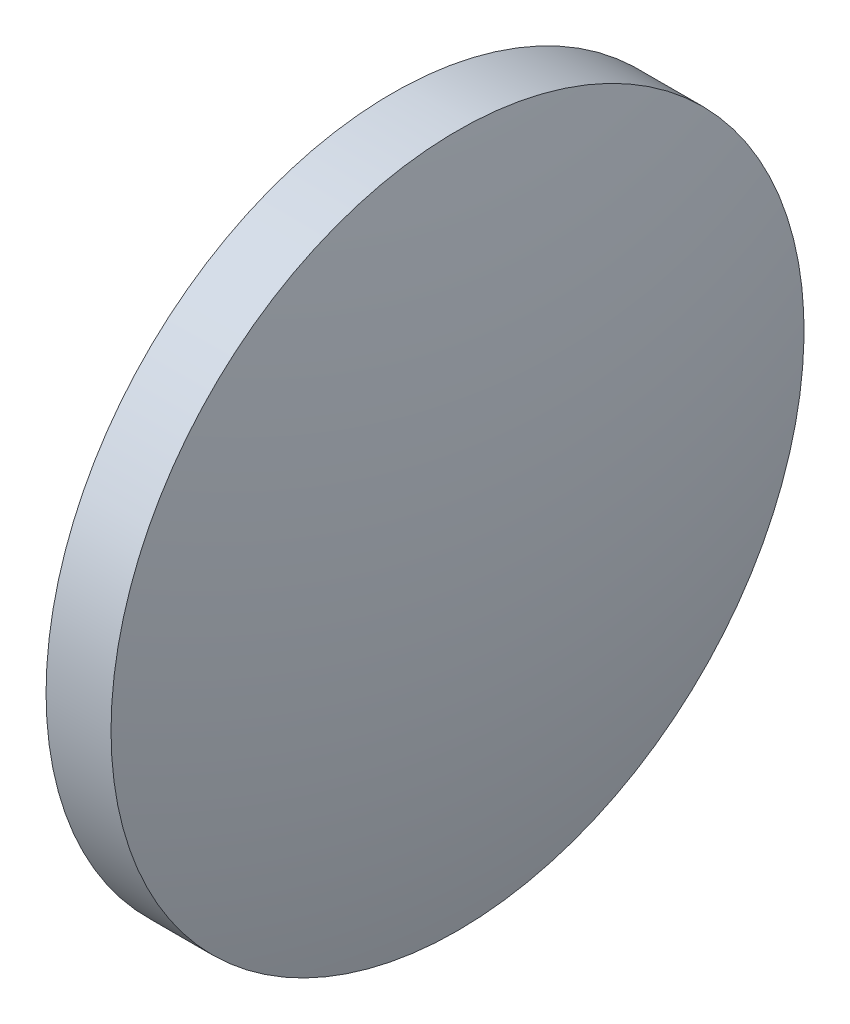
ISO-10303-21;
HEADER;
FILE_DESCRIPTION(('STEP AP214'),'2;1');
FILE_NAME('part.step','',(''),(''),'','','');
FILE_SCHEMA(('AUTOMOTIVE_DESIGN { 1 0 10303 214 1 1 1 1 }'));
ENDSEC;
DATA;
#1=APPLICATION_CONTEXT('core data for automotive mechanical design processes');
#2=APPLICATION_PROTOCOL_DEFINITION('international standard','automotive_design',2000,#1);
#3=PRODUCT_CONTEXT('',#1,'mechanical');
#4=PRODUCT('Part','Part','',(#3));
#5=PRODUCT_RELATED_PRODUCT_CATEGORY('part','',(#4));
#6=PRODUCT_DEFINITION_FORMATION('','',#4);
#7=PRODUCT_DEFINITION_CONTEXT('part definition',#1,'design');
#8=PRODUCT_DEFINITION('design','',#6,#7);
#9=PRODUCT_DEFINITION_SHAPE('','',#8);
#10=(LENGTH_UNIT() NAMED_UNIT(*) SI_UNIT(.MILLI.,.METRE.));
#11=(NAMED_UNIT(*) PLANE_ANGLE_UNIT() SI_UNIT($,.RADIAN.));
#12=(NAMED_UNIT(*) SI_UNIT($,.STERADIAN.) SOLID_ANGLE_UNIT());
#13=UNCERTAINTY_MEASURE_WITH_UNIT(LENGTH_MEASURE(1.E-05),#10,'distance_accuracy_value','');
#14=(GEOMETRIC_REPRESENTATION_CONTEXT(3) GLOBAL_UNCERTAINTY_ASSIGNED_CONTEXT((#13)) GLOBAL_UNIT_ASSIGNED_CONTEXT((#10,
#11,#12)) REPRESENTATION_CONTEXT('',''));
#15=CARTESIAN_POINT('',(0.,0.,0.));
#16=DIRECTION('',(0.,0.,1.));
#17=DIRECTION('',(1.,0.,0.));
#18=AXIS2_PLACEMENT_3D('',#15,#16,#17);
#19=CARTESIAN_POINT('',(494.160297715213,67.7770863223828,0.));
#20=DIRECTION('',(-1.,0.,0.));
#21=DIRECTION('',(0.,-1.,0.));
#22=AXIS2_PLACEMENT_3D('',#19,#20,#21);
#23=SPHERICAL_SURFACE('',#22,32.5);
#24=CARTESIAN_POINT('',(525.660297715213,67.7770863223826,0.));
#25=DIRECTION('',(-1.,0.,0.));
#26=DIRECTION('',(0.,0.,1.));
#27=AXIS2_PLACEMENT_3D('',#24,#25,#26);
#28=CIRCLE('',#27,7.99999999999999);
#29=CARTESIAN_POINT('',(525.660297715213,67.7770863223826,7.99999999999999));
#30=VERTEX_POINT('',#29);
#31=EDGE_CURVE('E10',#30,#30,#28,.T.);
#32=ORIENTED_EDGE('',*,*,#31,.F.);
#33=EDGE_LOOP('',(#32));
#34=FACE_BOUND('',#33,.T.);
#35=ADVANCED_FACE('F35',(#34),#23,.T.);
#36=CARTESIAN_POINT('',(522.237481010368,67.7770863223826,0.));
#37=DIRECTION('',(-1.,0.,0.));
#38=DIRECTION('',(0.,0.,1.));
#39=AXIS2_PLACEMENT_3D('',#36,#37,#38);
#40=CYLINDRICAL_SURFACE('',#39,7.99999999999999);
#41=CARTESIAN_POINT('',(524.160297715213,67.7770863223826,0.));
#42=DIRECTION('',(-1.,0.,0.));
#43=DIRECTION('',(0.,0.,1.));
#44=AXIS2_PLACEMENT_3D('',#41,#42,#43);
#45=CIRCLE('',#44,7.99999999999999);
#46=CARTESIAN_POINT('',(524.160297715213,67.7770863223826,7.99999999999999));
#47=VERTEX_POINT('',#46);
#48=EDGE_CURVE('E41',#47,#47,#45,.T.);
#49=ORIENTED_EDGE('',*,*,#48,.F.);
#50=EDGE_LOOP('',(#49));
#51=FACE_BOUND('',#50,.T.);
#52=ORIENTED_EDGE('',*,*,#31,.T.);
#53=EDGE_LOOP('',(#52));
#54=FACE_BOUND('',#53,.T.);
#55=ADVANCED_FACE('F49',(#51,#54),#40,.T.);
#56=CARTESIAN_POINT('',(524.160297715213,67.7770863223826,0.));
#57=DIRECTION('',(1.,0.,0.));
#58=DIRECTION('',(0.,0.,-1.));
#59=AXIS2_PLACEMENT_3D('',#56,#57,#58);
#60=PLANE('',#59);
#61=ORIENTED_EDGE('',*,*,#48,.T.);
#62=EDGE_LOOP('',(#61));
#63=FACE_BOUND('',#62,.T.);
#64=ADVANCED_FACE('F47',(#63),#60,.F.);
#65=CLOSED_SHELL('',(#35,#55,#64));
#66=MANIFOLD_SOLID_BREP('B2',#65);
#67=ADVANCED_BREP_SHAPE_REPRESENTATION('',(#18,#66),#14);
#68=SHAPE_DEFINITION_REPRESENTATION(#9,#67);
ENDSEC;
END-ISO-10303-21;
